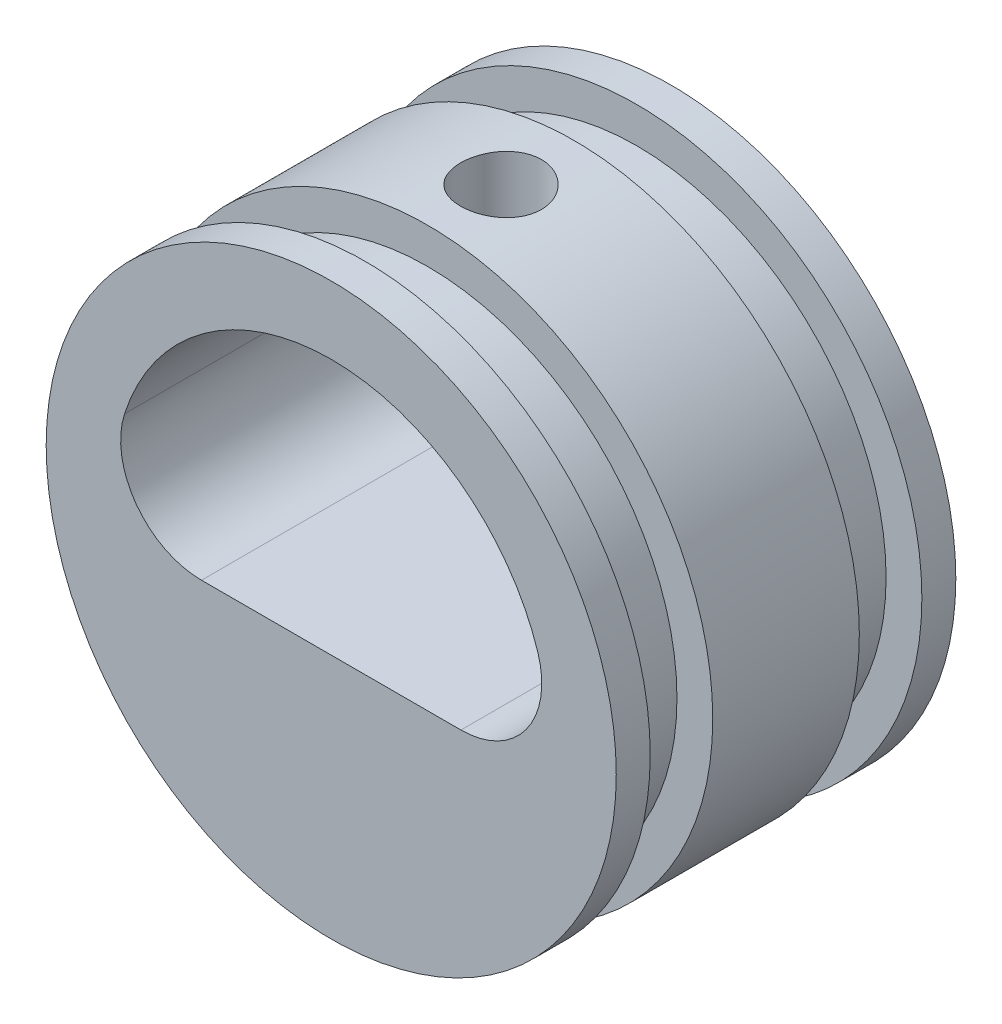
ISO-10303-21;
HEADER;
FILE_DESCRIPTION(('STEP AP214'),'2;1');
FILE_NAME('part.step','',(''),(''),'','','');
FILE_SCHEMA(('AUTOMOTIVE_DESIGN { 1 0 10303 214 1 1 1 1 }'));
ENDSEC;
DATA;
#1=APPLICATION_CONTEXT('core data for automotive mechanical design processes');
#2=APPLICATION_PROTOCOL_DEFINITION('international standard','automotive_design',2000,#1);
#3=PRODUCT_CONTEXT('',#1,'mechanical');
#4=PRODUCT('Part','Part','',(#3));
#5=PRODUCT_RELATED_PRODUCT_CATEGORY('part','',(#4));
#6=PRODUCT_DEFINITION_FORMATION('','',#4);
#7=PRODUCT_DEFINITION_CONTEXT('part definition',#1,'design');
#8=PRODUCT_DEFINITION('design','',#6,#7);
#9=PRODUCT_DEFINITION_SHAPE('','',#8);
#10=(LENGTH_UNIT() NAMED_UNIT(*) SI_UNIT(.MILLI.,.METRE.));
#11=(NAMED_UNIT(*) PLANE_ANGLE_UNIT() SI_UNIT($,.RADIAN.));
#12=(NAMED_UNIT(*) SI_UNIT($,.STERADIAN.) SOLID_ANGLE_UNIT());
#13=UNCERTAINTY_MEASURE_WITH_UNIT(LENGTH_MEASURE(1.E-05),#10,'distance_accuracy_value','');
#14=(GEOMETRIC_REPRESENTATION_CONTEXT(3) GLOBAL_UNCERTAINTY_ASSIGNED_CONTEXT((#13)) GLOBAL_UNIT_ASSIGNED_CONTEXT((#10,
#11,#12)) REPRESENTATION_CONTEXT('',''));
#15=CARTESIAN_POINT('',(0.,0.,0.));
#16=DIRECTION('',(0.,0.,1.));
#17=DIRECTION('',(1.,0.,0.));
#18=AXIS2_PLACEMENT_3D('',#15,#16,#17);
#19=CARTESIAN_POINT('',(0.,0.,20.));
#20=DIRECTION('',(0.,0.,-1.));
#21=DIRECTION('',(-1.,0.,0.));
#22=AXIS2_PLACEMENT_3D('',#19,#20,#21);
#23=CYLINDRICAL_SURFACE('',#22,16.7894);
#24=CARTESIAN_POINT('',(0.,16.7894,12.38125));
#25=CARTESIAN_POINT('',(-0.133039723001702,16.7893979515001,12.3812444520753));
#26=CARTESIAN_POINT('',(-0.266158705437617,16.7878020667245,12.3700630412981));
#27=CARTESIAN_POINT('',(-0.52868155316799,16.7815893262748,12.3256408746138));
#28=CARTESIAN_POINT('',(-0.658081575685149,16.7769694553636,12.2923781007593));
#29=CARTESIAN_POINT('',(-0.909328812036978,16.7652283575227,12.2048022318452));
#30=CARTESIAN_POINT('',(-1.03118144478502,16.758108950299,12.1505044476738));
#31=CARTESIAN_POINT('',(-1.26402538652919,16.7421572432115,12.0224359845219));
#32=CARTESIAN_POINT('',(-1.37501832258989,16.7333252005379,11.9486682287916));
#33=CARTESIAN_POINT('',(-1.58379102838226,16.7148624531769,11.7832018324144));
#34=CARTESIAN_POINT('',(-1.68148358485307,16.7052270879386,11.6913936613549));
#35=CARTESIAN_POINT('',(-1.86013038157043,16.6862805146017,11.4926881156981));
#36=CARTESIAN_POINT('',(-1.94108369865246,16.6769693244049,11.3857899094362));
#37=CARTESIAN_POINT('',(-2.08428873176347,16.6596799749315,11.1593590791464));
#38=CARTESIAN_POINT('',(-2.14645695183347,16.6517078351395,11.0397731491243));
#39=CARTESIAN_POINT('',(-2.24979361352576,16.6380622215792,10.7917254768098));
#40=CARTESIAN_POINT('',(-2.29096307782162,16.6323886358705,10.6632641671088));
#41=CARTESIAN_POINT('',(-2.35086463485187,16.6240279606292,10.4020257234354));
#42=CARTESIAN_POINT('',(-2.36974539201309,16.6213210920383,10.2692833223655));
#43=CARTESIAN_POINT('',(-2.3849939471313,16.6191401457265,10.0024887640838));
#44=CARTESIAN_POINT('',(-2.38136290288296,16.61966590175,9.86843667458414));
#45=CARTESIAN_POINT('',(-2.35181260394809,16.6238727062333,9.60387324612039));
#46=CARTESIAN_POINT('',(-2.32605829069648,16.6275304036605,9.4733430595547));
#47=CARTESIAN_POINT('',(-2.25325042899799,16.6375525079695,9.21847579862975));
#48=CARTESIAN_POINT('',(-2.20619633674287,16.6439169839581,9.0941388824819));
#49=CARTESIAN_POINT('',(-2.09195108319236,16.6586615666431,8.8546821319162));
#50=CARTESIAN_POINT('',(-2.02468943190207,16.6670487084601,8.73959637931242));
#51=CARTESIAN_POINT('',(-1.87198864802069,16.6848884075797,8.52228269718798));
#52=CARTESIAN_POINT('',(-1.78654844722834,16.6943410274762,8.42005552382038));
#53=CARTESIAN_POINT('',(-1.59900748498617,16.7133500151388,8.23040440893091));
#54=CARTESIAN_POINT('',(-1.49676478529153,16.7229065556918,8.14312078254419));
#55=CARTESIAN_POINT('',(-1.27900658689728,16.7409680367134,7.98693095690507));
#56=CARTESIAN_POINT('',(-1.16349104066162,16.7494729734155,7.91802482347369));
#57=CARTESIAN_POINT('',(-0.922349237447198,16.7644805349428,7.80054123598746));
#58=CARTESIAN_POINT('',(-0.796717984857946,16.7709821626951,7.75197390051226));
#59=CARTESIAN_POINT('',(-0.538970096236414,16.7812420079073,7.67666485798353));
#60=CARTESIAN_POINT('',(-0.406853852306016,16.7850003910145,7.64992183308628));
#61=CARTESIAN_POINT('',(-0.141098054078651,16.7893284853081,7.619205491697));
#62=CARTESIAN_POINT('',(-0.00748123480415352,16.7899252283942,7.6150391385192));
#63=CARTESIAN_POINT('',(0.25854398527548,16.7879361825917,7.62908305129991));
#64=CARTESIAN_POINT('',(0.390952419318937,16.7853504815082,7.64729269989505));
#65=CARTESIAN_POINT('',(0.650222800635544,16.777303820743,7.70541123443103));
#66=CARTESIAN_POINT('',(0.777106091153754,16.7718552340982,7.7452267664913));
#67=CARTESIAN_POINT('',(1.02239573138233,16.7586920718345,7.84532888746499));
#68=CARTESIAN_POINT('',(1.14080171983997,16.7509773997197,7.90561634814359));
#69=CARTESIAN_POINT('',(1.36662909647904,16.7340730096016,8.04540875627622));
#70=CARTESIAN_POINT('',(1.47397345400095,16.7248739608494,8.1250369941596));
#71=CARTESIAN_POINT('',(1.67384360303648,16.7060556885852,8.30107800131064));
#72=CARTESIAN_POINT('',(1.76636862852166,16.6964364433855,8.39749163769772));
#73=CARTESIAN_POINT('',(1.9346700349427,16.6777769995749,8.60522292251547));
#74=CARTESIAN_POINT('',(2.01031750231449,16.6687416089527,8.71664551178558));
#75=CARTESIAN_POINT('',(2.14182228150751,16.6523559821226,8.95072904342608));
#76=CARTESIAN_POINT('',(2.19768008231019,16.6450057042789,9.07338970802139));
#77=CARTESIAN_POINT('',(2.28781702250637,16.6328566833539,9.32607220455115));
#78=CARTESIAN_POINT('',(2.32216567281643,16.6280497289311,9.45606882852279));
#79=CARTESIAN_POINT('',(2.36853148551899,16.6215092102222,9.72005835418177));
#80=CARTESIAN_POINT('',(2.3805500134469,16.6197754580034,9.85405101099384));
#81=CARTESIAN_POINT('',(2.38188449759533,16.6195841477525,10.1209450367474));
#82=CARTESIAN_POINT('',(2.37140307771563,16.6210973491387,10.253845416356));
#83=CARTESIAN_POINT('',(2.32846763048212,16.6271661363191,10.5159737677576));
#84=CARTESIAN_POINT('',(2.29601362408935,16.6317217192109,10.6452017430538));
#85=CARTESIAN_POINT('',(2.21012309801584,16.6433521544804,10.8962709606339));
#86=CARTESIAN_POINT('',(2.15669923349699,16.6504254871745,11.0181166070011));
#87=CARTESIAN_POINT('',(2.03040549236661,16.6662964926152,11.2511476492611));
#88=CARTESIAN_POINT('',(1.9575350991004,16.6750942111737,11.3623327618186));
#89=CARTESIAN_POINT('',(1.79367503798112,16.6935172690754,11.5719184303428));
#90=CARTESIAN_POINT('',(1.70253491604991,16.7031490759923,11.6702008003513));
#91=CARTESIAN_POINT('',(1.50503992169551,16.7220999595909,11.8501500217005));
#92=CARTESIAN_POINT('',(1.39868150241679,16.731418962742,11.9318129888592));
#93=CARTESIAN_POINT('',(1.17316034366607,16.7487458988769,12.0765577835617));
#94=CARTESIAN_POINT('',(1.05393744160436,16.7567471868378,12.1395466438451));
#95=CARTESIAN_POINT('',(0.806551157014807,16.7704714832347,12.244514086155));
#96=CARTESIAN_POINT('',(0.678397355814999,16.7761968903902,12.2865148012167));
#97=CARTESIAN_POINT('',(0.458030737365101,16.7833918433555,12.3386020055319));
#98=CARTESIAN_POINT('',(0.367189040234292,16.7856335390287,12.354571074205));
#99=CARTESIAN_POINT('',(0.184244226049999,16.7886383189451,12.3758969367681));
#100=CARTESIAN_POINT('',(0.0921411222890621,16.7894014187573,12.3812538424013));
#101=CARTESIAN_POINT('',(0.,16.7894,12.38125));
#102=B_SPLINE_CURVE_WITH_KNOTS('',3,(#24,#25,#26,#27,#28,#29,#30,#31,#32,#33,#34,#35,#36,#37,
#38,#39,#40,#41,#42,#43,#44,#45,#46,#47,#48,#49,#50,#51,#52,#53,#54,#55,#56,#57,#58,#59,#60,#61,
#62,#63,#64,#65,#66,#67,#68,#69,#70,#71,#72,#73,#74,#75,#76,#77,#78,#79,#80,#81,#82,#83,#84,#85,
#86,#87,#88,#89,#90,#91,#92,#93,#94,#95,#96,#97,#98,#99,#100,#101),.UNSPECIFIED.,.T.,.F.,(4,2,2,
2,2,2,2,2,2,2,2,2,2,2,2,2,2,2,2,2,2,2,2,2,2,2,2,2,2,2,2,2,2,2,2,2,2,2,4),(0.,0.398782522014054,
0.797963279755463,1.1968540275007,1.59568491923971,1.99701656952287,2.39837034723784,
2.80148267284861,3.20457536435815,3.60496398021101,4.00533200402195,4.40274071210056,
4.80015956706014,5.19898115962658,5.59782619407706,6.00023219942481,6.40263964601467,
6.80524705370405,7.20783014846453,7.60696555241092,8.00608994428968,8.40350338876353,
8.80093375859214,9.20096734853795,9.60102161001417,10.0040342178101,10.4070368669017,
10.8087303222154,11.2103992122948,11.6084660460299,12.0065325000244,12.4043590921548,
12.8021962547801,13.203455237136,13.6048078917898,14.008126324346,14.4110185353786,
14.6872116543338,14.9634018650363),.UNSPECIFIED.);
#103=CARTESIAN_POINT('',(0.,16.7894,12.38125));
#104=VERTEX_POINT('',#103);
#105=EDGE_CURVE('E98',#104,#104,#102,.T.);
#106=ORIENTED_EDGE('',*,*,#105,.T.);
#107=EDGE_LOOP('',(#106));
#108=FACE_BOUND('',#107,.T.);
#109=CARTESIAN_POINT('',(0.,0.,14.317));
#110=DIRECTION('',(0.,0.,1.));
#111=DIRECTION('',(1.,0.,0.));
#112=AXIS2_PLACEMENT_3D('',#109,#110,#111);
#113=CIRCLE('',#112,16.7894);
#114=CARTESIAN_POINT('',(16.7894,0.,14.317));
#115=VERTEX_POINT('',#114);
#116=EDGE_CURVE('E117',#115,#115,#113,.T.);
#117=ORIENTED_EDGE('',*,*,#116,.F.);
#118=EDGE_LOOP('',(#117));
#119=FACE_BOUND('',#118,.T.);
#120=CARTESIAN_POINT('',(0.,0.,5.68299999999999));
#121=DIRECTION('',(0.,0.,1.));
#122=DIRECTION('',(1.,0.,0.));
#123=AXIS2_PLACEMENT_3D('',#120,#121,#122);
#124=CIRCLE('',#123,16.7894);
#125=CARTESIAN_POINT('',(16.7894,0.,5.68299999999999));
#126=VERTEX_POINT('',#125);
#127=EDGE_CURVE('E105',#126,#126,#124,.T.);
#128=ORIENTED_EDGE('',*,*,#127,.T.);
#129=EDGE_LOOP('',(#128));
#130=FACE_BOUND('',#129,.T.);
#131=ADVANCED_FACE('F32',(#108,#119,#130),#23,.T.);
#132=CARTESIAN_POINT('',(0.,0.,20.));
#133=DIRECTION('',(0.,0.,1.));
#134=DIRECTION('',(1.,0.,0.));
#135=AXIS2_PLACEMENT_3D('',#132,#133,#134);
#136=CIRCLE('',#135,16.7894);
#137=CARTESIAN_POINT('',(16.7894,0.,20.));
#138=VERTEX_POINT('',#137);
#139=EDGE_CURVE('E127',#138,#138,#136,.T.);
#140=ORIENTED_EDGE('',*,*,#139,.F.);
#141=EDGE_LOOP('',(#140));
#142=FACE_BOUND('',#141,.T.);
#143=CARTESIAN_POINT('',(0.,0.,18.));
#144=DIRECTION('',(0.,0.,1.));
#145=DIRECTION('',(1.,0.,0.));
#146=AXIS2_PLACEMENT_3D('',#143,#144,#145);
#147=CIRCLE('',#146,16.7894);
#148=CARTESIAN_POINT('',(16.7894,0.,18.));
#149=VERTEX_POINT('',#148);
#150=EDGE_CURVE('E114',#149,#149,#147,.T.);
#151=ORIENTED_EDGE('',*,*,#150,.T.);
#152=EDGE_LOOP('',(#151));
#153=FACE_BOUND('',#152,.T.);
#154=ADVANCED_FACE('F150',(#142,#153),#23,.T.);
#155=CARTESIAN_POINT('',(0.,0.,20.));
#156=DIRECTION('',(0.,0.,1.));
#157=DIRECTION('',(1.,0.,0.));
#158=AXIS2_PLACEMENT_3D('',#155,#156,#157);
#159=PLANE('',#158);
#160=CARTESIAN_POINT('',(0.,0.,20.));
#161=DIRECTION('',(0.,0.,1.));
#162=DIRECTION('',(1.,0.,0.));
#163=AXIS2_PLACEMENT_3D('',#160,#161,#162);
#164=CIRCLE('',#163,12.7894);
#165=CARTESIAN_POINT('',(12.1726970356732,3.92354421890633,20.));
#166=VERTEX_POINT('',#165);
#167=CARTESIAN_POINT('',(-12.1726970356732,3.92354421890633,20.));
#168=VERTEX_POINT('',#167);
#169=EDGE_CURVE('E95',#166,#168,#164,.T.);
#170=ORIENTED_EDGE('',*,*,#169,.F.);
#171=CARTESIAN_POINT('',(7.63984407678586,2.462499968,20.));
#172=DIRECTION('',(0.,0.,1.));
#173=DIRECTION('',(1.,0.,0.));
#174=AXIS2_PLACEMENT_3D('',#171,#172,#173);
#175=CIRCLE('',#174,4.7625);
#176=CARTESIAN_POINT('',(7.63984407678586,-2.300000032,20.));
#177=VERTEX_POINT('',#176);
#178=EDGE_CURVE('E40',#166,#177,#175,.F.);
#179=ORIENTED_EDGE('',*,*,#178,.T.);
#180=DIRECTION('',(1.,0.,0.));
#181=VECTOR('',#180,1.);
#182=CARTESIAN_POINT('',(-12.5808883713671,-2.300000032,20.));
#183=LINE('',#182,#181);
#184=CARTESIAN_POINT('',(-7.63984407678586,-2.300000032,20.));
#185=VERTEX_POINT('',#184);
#186=EDGE_CURVE('E86',#185,#177,#183,.T.);
#187=ORIENTED_EDGE('',*,*,#186,.F.);
#188=CARTESIAN_POINT('',(-7.63984407678586,2.462499968,20.));
#189=DIRECTION('',(0.,0.,1.));
#190=DIRECTION('',(1.,0.,0.));
#191=AXIS2_PLACEMENT_3D('',#188,#189,#190);
#192=CIRCLE('',#191,4.7625);
#193=EDGE_CURVE('E72',#185,#168,#192,.F.);
#194=ORIENTED_EDGE('',*,*,#193,.T.);
#195=EDGE_LOOP('',(#170,#179,#187,#194));
#196=FACE_BOUND('',#195,.T.);
#197=ORIENTED_EDGE('',*,*,#139,.T.);
#198=EDGE_LOOP('',(#197));
#199=FACE_BOUND('',#198,.T.);
#200=ADVANCED_FACE('F92',(#196,#199),#159,.T.);
#201=CARTESIAN_POINT('',(0.,16.7894,18.));
#202=DIRECTION('',(0.,0.,-1.));
#203=DIRECTION('',(-1.,0.,0.));
#204=AXIS2_PLACEMENT_3D('',#201,#202,#203);
#205=PLANE('',#204);
#206=CARTESIAN_POINT('',(0.,0.,18.));
#207=DIRECTION('',(0.,0.,1.));
#208=DIRECTION('',(1.,0.,0.));
#209=AXIS2_PLACEMENT_3D('',#206,#207,#208);
#210=CIRCLE('',#209,14.6812);
#211=CARTESIAN_POINT('',(14.6812,0.,18.));
#212=VERTEX_POINT('',#211);
#213=EDGE_CURVE('E123',#212,#212,#210,.T.);
#214=ORIENTED_EDGE('',*,*,#213,.T.);
#215=EDGE_LOOP('',(#214));
#216=FACE_BOUND('',#215,.T.);
#217=ORIENTED_EDGE('',*,*,#150,.F.);
#218=EDGE_LOOP('',(#217));
#219=FACE_BOUND('',#218,.T.);
#220=ADVANCED_FACE('F203',(#216,#219),#205,.T.);
#221=CARTESIAN_POINT('',(0.,0.,21.2407494083647));
#222=DIRECTION('',(0.,0.,1.));
#223=DIRECTION('',(1.,0.,0.));
#224=AXIS2_PLACEMENT_3D('',#221,#222,#223);
#225=CYLINDRICAL_SURFACE('',#224,14.6812);
#226=CARTESIAN_POINT('',(0.,0.,14.317));
#227=DIRECTION('',(0.,0.,1.));
#228=DIRECTION('',(1.,0.,0.));
#229=AXIS2_PLACEMENT_3D('',#226,#227,#228);
#230=CIRCLE('',#229,14.6812);
#231=CARTESIAN_POINT('',(14.6812,0.,14.317));
#232=VERTEX_POINT('',#231);
#233=EDGE_CURVE('E120',#232,#232,#230,.T.);
#234=ORIENTED_EDGE('',*,*,#233,.T.);
#235=EDGE_LOOP('',(#234));
#236=FACE_BOUND('',#235,.T.);
#237=ORIENTED_EDGE('',*,*,#213,.F.);
#238=EDGE_LOOP('',(#237));
#239=FACE_BOUND('',#238,.T.);
#240=ADVANCED_FACE('F199',(#236,#239),#225,.T.);
#241=CARTESIAN_POINT('',(0.,16.7894,14.317));
#242=DIRECTION('',(0.,0.,1.));
#243=DIRECTION('',(1.,0.,0.));
#244=AXIS2_PLACEMENT_3D('',#241,#242,#243);
#245=PLANE('',#244);
#246=ORIENTED_EDGE('',*,*,#116,.T.);
#247=EDGE_LOOP('',(#246));
#248=FACE_BOUND('',#247,.T.);
#249=ORIENTED_EDGE('',*,*,#233,.F.);
#250=EDGE_LOOP('',(#249));
#251=FACE_BOUND('',#250,.T.);
#252=ADVANCED_FACE('F179',(#248,#251),#245,.T.);
#253=CARTESIAN_POINT('',(0.,16.7894,2.));
#254=DIRECTION('',(0.,0.,1.));
#255=DIRECTION('',(1.,0.,0.));
#256=AXIS2_PLACEMENT_3D('',#253,#254,#255);
#257=PLANE('',#256);
#258=CARTESIAN_POINT('',(0.,0.,2.));
#259=DIRECTION('',(0.,0.,1.));
#260=DIRECTION('',(1.,0.,0.));
#261=AXIS2_PLACEMENT_3D('',#258,#259,#260);
#262=CIRCLE('',#261,16.7894);
#263=CARTESIAN_POINT('',(16.7894,0.,2.));
#264=VERTEX_POINT('',#263);
#265=EDGE_CURVE('E102',#264,#264,#262,.T.);
#266=ORIENTED_EDGE('',*,*,#265,.T.);
#267=EDGE_LOOP('',(#266));
#268=FACE_BOUND('',#267,.T.);
#269=CARTESIAN_POINT('',(0.,0.,2.));
#270=DIRECTION('',(0.,0.,1.));
#271=DIRECTION('',(1.,0.,0.));
#272=AXIS2_PLACEMENT_3D('',#269,#270,#271);
#273=CIRCLE('',#272,14.6812);
#274=CARTESIAN_POINT('',(14.6812,0.,2.));
#275=VERTEX_POINT('',#274);
#276=EDGE_CURVE('E111',#275,#275,#273,.T.);
#277=ORIENTED_EDGE('',*,*,#276,.F.);
#278=EDGE_LOOP('',(#277));
#279=FACE_BOUND('',#278,.T.);
#280=ADVANCED_FACE('F175',(#268,#279),#257,.T.);
#281=CARTESIAN_POINT('',(0.,0.,21.2407494083647));
#282=DIRECTION('',(0.,0.,1.));
#283=DIRECTION('',(1.,0.,0.));
#284=AXIS2_PLACEMENT_3D('',#281,#282,#283);
#285=CYLINDRICAL_SURFACE('',#284,14.6812);
#286=ORIENTED_EDGE('',*,*,#276,.T.);
#287=EDGE_LOOP('',(#286));
#288=FACE_BOUND('',#287,.T.);
#289=CARTESIAN_POINT('',(0.,0.,5.683));
#290=DIRECTION('',(0.,0.,1.));
#291=DIRECTION('',(1.,0.,0.));
#292=AXIS2_PLACEMENT_3D('',#289,#290,#291);
#293=CIRCLE('',#292,14.6812);
#294=CARTESIAN_POINT('',(14.6812,0.,5.683));
#295=VERTEX_POINT('',#294);
#296=EDGE_CURVE('E108',#295,#295,#293,.T.);
#297=ORIENTED_EDGE('',*,*,#296,.F.);
#298=EDGE_LOOP('',(#297));
#299=FACE_BOUND('',#298,.T.);
#300=ADVANCED_FACE('F178',(#288,#299),#285,.T.);
#301=CARTESIAN_POINT('',(0.,16.7894,5.683));
#302=DIRECTION('',(0.,0.,-1.));
#303=DIRECTION('',(-1.,0.,0.));
#304=AXIS2_PLACEMENT_3D('',#301,#302,#303);
#305=PLANE('',#304);
#306=ORIENTED_EDGE('',*,*,#296,.T.);
#307=EDGE_LOOP('',(#306));
#308=FACE_BOUND('',#307,.T.);
#309=ORIENTED_EDGE('',*,*,#127,.F.);
#310=EDGE_LOOP('',(#309));
#311=FACE_BOUND('',#310,.T.);
#312=ADVANCED_FACE('F170',(#308,#311),#305,.T.);
#313=CARTESIAN_POINT('',(0.,0.,0.));
#314=DIRECTION('',(0.,0.,1.));
#315=DIRECTION('',(1.,0.,0.));
#316=AXIS2_PLACEMENT_3D('',#313,#314,#315);
#317=PLANE('',#316);
#318=CARTESIAN_POINT('',(0.,0.,0.));
#319=DIRECTION('',(0.,0.,1.));
#320=DIRECTION('',(1.,0.,0.));
#321=AXIS2_PLACEMENT_3D('',#318,#319,#320);
#322=CIRCLE('',#321,12.7894);
#323=CARTESIAN_POINT('',(12.1726970356732,3.92354421890633,0.));
#324=VERTEX_POINT('',#323);
#325=CARTESIAN_POINT('',(-12.1726970356732,3.92354421890633,0.));
#326=VERTEX_POINT('',#325);
#327=EDGE_CURVE('E94',#324,#326,#322,.T.);
#328=ORIENTED_EDGE('',*,*,#327,.T.);
#329=CARTESIAN_POINT('',(-7.63984407678586,2.462499968,0.));
#330=DIRECTION('',(0.,0.,1.));
#331=DIRECTION('',(1.,0.,0.));
#332=AXIS2_PLACEMENT_3D('',#329,#330,#331);
#333=CIRCLE('',#332,4.7625);
#334=CARTESIAN_POINT('',(-7.63984407678586,-2.300000032,0.));
#335=VERTEX_POINT('',#334);
#336=EDGE_CURVE('E80',#326,#335,#333,.T.);
#337=ORIENTED_EDGE('',*,*,#336,.T.);
#338=DIRECTION('',(1.,0.,0.));
#339=VECTOR('',#338,1.);
#340=CARTESIAN_POINT('',(-12.5808883713671,-2.300000032,0.));
#341=LINE('',#340,#339);
#342=CARTESIAN_POINT('',(7.63984407678586,-2.300000032,0.));
#343=VERTEX_POINT('',#342);
#344=EDGE_CURVE('E88',#335,#343,#341,.T.);
#345=ORIENTED_EDGE('',*,*,#344,.T.);
#346=CARTESIAN_POINT('',(7.63984407678586,2.462499968,0.));
#347=DIRECTION('',(0.,0.,1.));
#348=DIRECTION('',(1.,0.,0.));
#349=AXIS2_PLACEMENT_3D('',#346,#347,#348);
#350=CIRCLE('',#349,4.7625);
#351=EDGE_CURVE('E11',#343,#324,#350,.T.);
#352=ORIENTED_EDGE('',*,*,#351,.T.);
#353=EDGE_LOOP('',(#328,#337,#345,#352));
#354=FACE_BOUND('',#353,.T.);
#355=CARTESIAN_POINT('',(0.,0.,0.));
#356=DIRECTION('',(0.,0.,1.));
#357=DIRECTION('',(1.,0.,0.));
#358=AXIS2_PLACEMENT_3D('',#355,#356,#357);
#359=CIRCLE('',#358,16.7894);
#360=CARTESIAN_POINT('',(16.7894,0.,0.));
#361=VERTEX_POINT('',#360);
#362=EDGE_CURVE('E126',#361,#361,#359,.T.);
#363=ORIENTED_EDGE('',*,*,#362,.F.);
#364=EDGE_LOOP('',(#363));
#365=FACE_BOUND('',#364,.T.);
#366=ADVANCED_FACE('F136',(#354,#365),#317,.F.);
#367=ORIENTED_EDGE('',*,*,#362,.T.);
#368=EDGE_LOOP('',(#367));
#369=FACE_BOUND('',#368,.T.);
#370=ORIENTED_EDGE('',*,*,#265,.F.);
#371=EDGE_LOOP('',(#370));
#372=FACE_BOUND('',#371,.T.);
#373=ADVANCED_FACE('F153',(#369,#372),#23,.T.);
#374=CARTESIAN_POINT('',(0.,0.,0.));
#375=DIRECTION('',(0.,0.,1.));
#376=DIRECTION('',(1.,0.,0.));
#377=AXIS2_PLACEMENT_3D('',#374,#375,#376);
#378=CYLINDRICAL_SURFACE('',#377,12.7894);
#379=CARTESIAN_POINT('',(0.,12.7894,12.38125));
#380=CARTESIAN_POINT('',(0.132528508515151,12.7893976060126,12.381244917898));
#381=CARTESIAN_POINT('',(0.265123335461501,12.7873187542451,12.3701487995521));
#382=CARTESIAN_POINT('',(0.526577705445728,12.7792261623774,12.3260854100647));
#383=CARTESIAN_POINT('',(0.65543398029143,12.7732090817038,12.2930995707996));
#384=CARTESIAN_POINT('',(0.905592135386399,12.7579132380938,12.2063008044769));
#385=CARTESIAN_POINT('',(1.026900682708,12.7486374032517,12.1525065700556));
#386=CARTESIAN_POINT('',(1.25875893555977,12.727837422492,12.0256708266982));
#387=CARTESIAN_POINT('',(1.36930953449042,12.7163134635103,11.9526309179019));
#388=CARTESIAN_POINT('',(1.57783151503698,12.6921373086944,11.788460876214));
#389=CARTESIAN_POINT('',(1.67565738947623,12.6794744634314,11.6971474753138));
#390=CARTESIAN_POINT('',(1.85469434684237,12.6545269195253,11.4994167533701));
#391=CARTESIAN_POINT('',(1.93590424629255,12.6422422478706,11.3929983573834));
#392=CARTESIAN_POINT('',(2.08000775400936,12.6193384799733,11.1670520510389));
#393=CARTESIAN_POINT('',(2.14275361775041,12.60873311661,11.0474283980072));
#394=CARTESIAN_POINT('',(2.2472021948108,12.5905386472182,10.7991073353162));
#395=CARTESIAN_POINT('',(2.28890669641909,12.5829492848739,10.6704106978227));
#396=CARTESIAN_POINT('',(2.34962228674378,12.5717532221454,10.4091528704546));
#397=CARTESIAN_POINT('',(2.36888696887829,12.5681020516871,10.2766525583654));
#398=CARTESIAN_POINT('',(2.38496314895352,12.5650616678488,10.0102538858618));
#399=CARTESIAN_POINT('',(2.38177663203065,12.5656720776596,9.87635565009715));
#400=CARTESIAN_POINT('',(2.35324656048169,12.5710453904638,9.61279747298535));
#401=CARTESIAN_POINT('',(2.32819113938398,12.5757542915698,9.48310507786278));
#402=CARTESIAN_POINT('',(2.25708815293282,12.5887092091955,9.22979738828708));
#403=CARTESIAN_POINT('',(2.21103970682756,12.5969553741186,9.10618234904746));
#404=CARTESIAN_POINT('',(2.09897535119363,12.6161122606522,8.86769399440736));
#405=CARTESIAN_POINT('',(2.03284287918943,12.6270384633329,8.75287674594596));
#406=CARTESIAN_POINT('',(1.88257018757215,12.6503140476247,8.53586030712959));
#407=CARTESIAN_POINT('',(1.79842816500683,12.6626635716687,8.43366238172286));
#408=CARTESIAN_POINT('',(1.61297028061796,12.6876297508635,8.24312064802722));
#409=CARTESIAN_POINT('',(1.51140791769077,12.7002475754123,8.15501674157879));
#410=CARTESIAN_POINT('',(1.29481775958478,12.7241522580833,7.99706126100441));
#411=CARTESIAN_POINT('',(1.17978983295886,12.7354391032108,7.92720986507595));
#412=CARTESIAN_POINT('',(0.939285154848163,12.7554324121726,7.80770778325352));
#413=CARTESIAN_POINT('',(0.813795850197068,12.7641357170905,7.75808179972983));
#414=CARTESIAN_POINT('',(0.556064233890999,12.777956851777,7.68068047340824));
#415=CARTESIAN_POINT('',(0.42382263099974,12.7830750570334,7.65290284227033));
#416=CARTESIAN_POINT('',(0.158404482548302,12.7890978042724,7.62032006856665));
#417=CARTESIAN_POINT('',(0.02526961720903,12.7900626402566,7.61518618207096));
#418=CARTESIAN_POINT('',(-0.239956297546723,12.7878363952278,7.62715516272561));
#419=CARTESIAN_POINT('',(-0.372047397192695,12.7846455154424,7.64425695318309));
#420=CARTESIAN_POINT('',(-0.630395275697432,12.7745039016133,7.69993850506041));
#421=CARTESIAN_POINT('',(-0.756689096820119,12.767582257216,7.73835215992314));
#422=CARTESIAN_POINT('',(-1.00104386020628,12.7507520202558,7.83538744305956));
#423=CARTESIAN_POINT('',(-1.1191042489443,12.7408432271077,7.89401042841482));
#424=CARTESIAN_POINT('',(-1.3450454980622,12.7189874339391,8.03052956194838));
#425=CARTESIAN_POINT('',(-1.45280274886217,12.707019591362,8.10862688118515));
#426=CARTESIAN_POINT('',(-1.65380027112587,12.6824275693267,8.28160526938681));
#427=CARTESIAN_POINT('',(-1.74703920574808,12.6698033295701,8.37648788221946));
#428=CARTESIAN_POINT('',(-1.91760053885537,12.6451216501742,8.58183088296619));
#429=CARTESIAN_POINT('',(-1.99469873315864,12.6330737872427,8.69247884069432));
#430=CARTESIAN_POINT('',(-2.12921441471248,12.6111007844143,8.92534849575114));
#431=CARTESIAN_POINT('',(-2.18663262703904,12.601175566317,9.04756976646869));
#432=CARTESIAN_POINT('',(-2.27983942604436,12.5846465711774,9.29954363997779));
#433=CARTESIAN_POINT('',(-2.3157313552008,12.5780269508421,9.42925692795529));
#434=CARTESIAN_POINT('',(-2.36518591019085,12.5688222164798,9.6930074594984));
#435=CARTESIAN_POINT('',(-2.3787510161816,12.5662366543343,9.82704422110765));
#436=CARTESIAN_POINT('',(-2.38308477777057,12.5654152889567,10.0933915733695));
#437=CARTESIAN_POINT('',(-2.37420703966569,12.5671120139194,10.2256963318435));
#438=CARTESIAN_POINT('',(-2.33468065254013,12.5745145480692,10.486892576437));
#439=CARTESIAN_POINT('',(-2.30403212929735,12.5802203340944,10.6157840822716));
#440=CARTESIAN_POINT('',(-2.22198247823545,12.5949698592636,10.8663083810929));
#441=CARTESIAN_POINT('',(-2.17061912491409,12.6040075200099,10.9879539265054));
#442=CARTESIAN_POINT('',(-2.04863633820006,12.6244068732133,11.2209574767538));
#443=CARTESIAN_POINT('',(-1.9780155706405,12.6357687266784,11.3323147680964));
#444=CARTESIAN_POINT('',(-1.81829111071407,12.6597460118671,11.5433530828457));
#445=CARTESIAN_POINT('',(-1.72892988367077,12.6723774774092,11.6428374023169));
#446=CARTESIAN_POINT('',(-1.53479859598456,12.6973502673287,11.8255170578738));
#447=CARTESIAN_POINT('',(-1.43002499985205,12.709691524379,11.9087086462856));
#448=CARTESIAN_POINT('',(-1.20693156652647,12.7328215250814,12.0571289412022));
#449=CARTESIAN_POINT('',(-1.08849994481239,12.7435955462705,12.122191983508));
#450=CARTESIAN_POINT('',(-0.84222477126251,12.7622334273177,12.2313937077727));
#451=CARTESIAN_POINT('',(-0.714390227540542,12.7701000300792,12.2755521225865));
#452=CARTESIAN_POINT('',(-0.488476319988329,12.7804253970098,12.332683848881));
#453=CARTESIAN_POINT('',(-0.391720923132318,12.7837719346953,12.3508651612033));
#454=CARTESIAN_POINT('',(-0.196655831754305,12.7882600970886,12.3751499725365));
#455=CARTESIAN_POINT('',(-0.0983461758691258,12.7894017765197,12.381253771304));
#456=CARTESIAN_POINT('',(0.,12.7894,12.38125));
#457=B_SPLINE_CURVE_WITH_KNOTS('',3,(#379,#380,#381,#382,#383,#384,#385,#386,#387,#388,#389,
#390,#391,#392,#393,#394,#395,#396,#397,#398,#399,#400,#401,#402,#403,#404,#405,#406,#407,#408,
#409,#410,#411,#412,#413,#414,#415,#416,#417,#418,#419,#420,#421,#422,#423,#424,#425,#426,#427,
#428,#429,#430,#431,#432,#433,#434,#435,#436,#437,#438,#439,#440,#441,#442,#443,#444,#445,#446,
#447,#448,#449,#450,#451,#452,#453,#454,#455,#456),.UNSPECIFIED.,.T.,.F.,(4,2,2,2,2,2,2,2,2,2,2,
2,2,2,2,2,2,2,2,2,2,2,2,2,2,2,2,2,2,2,2,2,2,2,2,2,2,2,4),(0.,0.39722587893109,0.794789139203732,
1.19199608602127,1.58917001834128,1.99054723346871,2.39195302683776,2.79648848674024,
3.20098955969598,3.60087358222844,4.00072224743465,4.39538090729062,4.79005612637641,
5.18706719128009,5.58411801992278,5.98733736122689,6.39056063897521,6.79427492943787,
7.19794693027525,7.59573867691256,7.99351116245076,8.38822606511638,8.78296747854117,
9.18196900144934,9.58100724258134,9.98526629466097,10.3895104508912,10.7917980626118,
11.1940409835211,11.5899858495506,11.9859284280785,12.3811522274077,12.7764034150728,
13.1774912093703,13.5786711542934,13.983405193543,14.3877564198487,14.6825353787986,
14.9773070214197),.UNSPECIFIED.);
#458=CARTESIAN_POINT('',(0.,12.7894,12.38125));
#459=VERTEX_POINT('',#458);
#460=EDGE_CURVE('E302',#459,#459,#457,.T.);
#461=ORIENTED_EDGE('',*,*,#460,.T.);
#462=EDGE_LOOP('',(#461));
#463=FACE_BOUND('',#462,.T.);
#464=ORIENTED_EDGE('',*,*,#169,.T.);
#465=DIRECTION('',(0.,0.,1.));
#466=VECTOR('',#465,1.);
#467=CARTESIAN_POINT('',(-12.1726970356732,3.92354421890633,0.));
#468=LINE('',#467,#466);
#469=EDGE_CURVE('E47',#168,#326,#468,.F.);
#470=ORIENTED_EDGE('',*,*,#469,.T.);
#471=ORIENTED_EDGE('',*,*,#327,.F.);
#472=DIRECTION('',(0.,0.,1.));
#473=VECTOR('',#472,1.);
#474=CARTESIAN_POINT('',(12.1726970356732,3.92354421890633,0.));
#475=LINE('',#474,#473);
#476=EDGE_CURVE('E89',#324,#166,#475,.T.);
#477=ORIENTED_EDGE('',*,*,#476,.T.);
#478=EDGE_LOOP('',(#464,#470,#471,#477));
#479=FACE_BOUND('',#478,.T.);
#480=ADVANCED_FACE('F139',(#463,#479),#378,.F.);
#481=CARTESIAN_POINT('',(-12.5808883713671,-2.300000032,0.));
#482=DIRECTION('',(0.,-1.,0.));
#483=DIRECTION('',(0.,0.,-1.));
#484=AXIS2_PLACEMENT_3D('',#481,#482,#483);
#485=PLANE('',#484);
#486=ORIENTED_EDGE('',*,*,#344,.F.);
#487=DIRECTION('',(0.,0.,-1.));
#488=VECTOR('',#487,1.);
#489=CARTESIAN_POINT('',(-7.63984407678586,-2.300000032,20.));
#490=LINE('',#489,#488);
#491=EDGE_CURVE('E76',#335,#185,#490,.F.);
#492=ORIENTED_EDGE('',*,*,#491,.T.);
#493=ORIENTED_EDGE('',*,*,#186,.T.);
#494=DIRECTION('',(0.,0.,-1.));
#495=VECTOR('',#494,1.);
#496=CARTESIAN_POINT('',(7.63984407678586,-2.300000032,0.));
#497=LINE('',#496,#495);
#498=EDGE_CURVE('E90',#177,#343,#497,.T.);
#499=ORIENTED_EDGE('',*,*,#498,.T.);
#500=EDGE_LOOP('',(#486,#492,#493,#499));
#501=FACE_BOUND('',#500,.T.);
#502=ADVANCED_FACE('F85',(#501),#485,.F.);
#503=CARTESIAN_POINT('',(-7.63984407678586,2.462499968,0.));
#504=DIRECTION('',(0.,0.,1.));
#505=DIRECTION('',(1.,0.,0.));
#506=AXIS2_PLACEMENT_3D('',#503,#504,#505);
#507=CYLINDRICAL_SURFACE('',#506,4.7625);
#508=ORIENTED_EDGE('',*,*,#336,.F.);
#509=ORIENTED_EDGE('',*,*,#469,.F.);
#510=ORIENTED_EDGE('',*,*,#193,.F.);
#511=ORIENTED_EDGE('',*,*,#491,.F.);
#512=EDGE_LOOP('',(#508,#509,#510,#511));
#513=FACE_BOUND('',#512,.T.);
#514=ADVANCED_FACE('F75',(#513),#507,.F.);
#515=CARTESIAN_POINT('',(7.63984407678586,2.462499968,0.));
#516=DIRECTION('',(0.,0.,1.));
#517=DIRECTION('',(1.,0.,0.));
#518=AXIS2_PLACEMENT_3D('',#515,#516,#517);
#519=CYLINDRICAL_SURFACE('',#518,4.7625);
#520=ORIENTED_EDGE('',*,*,#351,.F.);
#521=ORIENTED_EDGE('',*,*,#498,.F.);
#522=ORIENTED_EDGE('',*,*,#178,.F.);
#523=ORIENTED_EDGE('',*,*,#476,.F.);
#524=EDGE_LOOP('',(#520,#521,#522,#523));
#525=FACE_BOUND('',#524,.T.);
#526=ADVANCED_FACE('F34',(#525),#519,.F.);
#527=CARTESIAN_POINT('',(0.,16.7894,10.));
#528=DIRECTION('',(0.,1.,0.));
#529=DIRECTION('',(0.,0.,1.));
#530=AXIS2_PLACEMENT_3D('',#527,#528,#529);
#531=CYLINDRICAL_SURFACE('',#530,2.38125);
#532=ORIENTED_EDGE('',*,*,#460,.F.);
#533=EDGE_LOOP('',(#532));
#534=FACE_BOUND('',#533,.T.);
#535=ORIENTED_EDGE('',*,*,#105,.F.);
#536=EDGE_LOOP('',(#535));
#537=FACE_BOUND('',#536,.T.);
#538=ADVANCED_FACE('F142',(#534,#537),#531,.F.);
#539=CLOSED_SHELL('',(#131,#154,#200,#220,#240,#252,#280,#300,#312,#366,#373,#480,#502,#514,
#526,#538));
#540=MANIFOLD_SOLID_BREP('B2',#539);
#541=ADVANCED_BREP_SHAPE_REPRESENTATION('',(#18,#540),#14);
#542=SHAPE_DEFINITION_REPRESENTATION(#9,#541);
ENDSEC;
END-ISO-10303-21;
